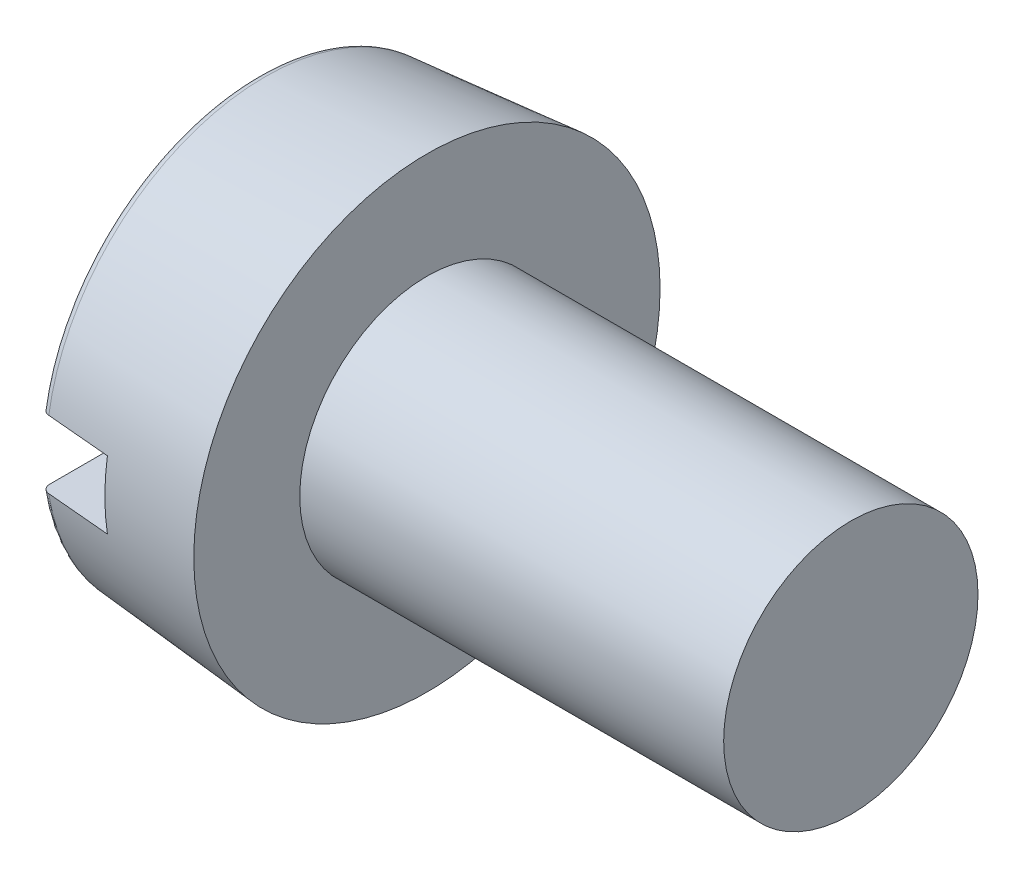
ISO-10303-21;
HEADER;
FILE_DESCRIPTION(('STEP AP214'),'2;1');
FILE_NAME('part.step','',(''),(''),'','','');
FILE_SCHEMA(('AUTOMOTIVE_DESIGN { 1 0 10303 214 1 1 1 1 }'));
ENDSEC;
DATA;
#1=APPLICATION_CONTEXT('core data for automotive mechanical design processes');
#2=APPLICATION_PROTOCOL_DEFINITION('international standard','automotive_design',2000,#1);
#3=PRODUCT_CONTEXT('',#1,'mechanical');
#4=PRODUCT('Part','Part','',(#3));
#5=PRODUCT_RELATED_PRODUCT_CATEGORY('part','',(#4));
#6=PRODUCT_DEFINITION_FORMATION('','',#4);
#7=PRODUCT_DEFINITION_CONTEXT('part definition',#1,'design');
#8=PRODUCT_DEFINITION('design','',#6,#7);
#9=PRODUCT_DEFINITION_SHAPE('','',#8);
#10=(LENGTH_UNIT() NAMED_UNIT(*) SI_UNIT(.MILLI.,.METRE.));
#11=(NAMED_UNIT(*) PLANE_ANGLE_UNIT() SI_UNIT($,.RADIAN.));
#12=(NAMED_UNIT(*) SI_UNIT($,.STERADIAN.) SOLID_ANGLE_UNIT());
#13=UNCERTAINTY_MEASURE_WITH_UNIT(LENGTH_MEASURE(1.E-05),#10,'distance_accuracy_value','');
#14=(GEOMETRIC_REPRESENTATION_CONTEXT(3) GLOBAL_UNCERTAINTY_ASSIGNED_CONTEXT((#13)) GLOBAL_UNIT_ASSIGNED_CONTEXT((#10,
#11,#12)) REPRESENTATION_CONTEXT('',''));
#15=CARTESIAN_POINT('',(0.,0.,0.));
#16=DIRECTION('',(0.,0.,1.));
#17=DIRECTION('',(1.,0.,0.));
#18=AXIS2_PLACEMENT_3D('',#15,#16,#17);
#19=CARTESIAN_POINT('',(0.,0.,0.));
#20=DIRECTION('',(-1.,0.,0.));
#21=DIRECTION('',(0.,0.,1.));
#22=AXIS2_PLACEMENT_3D('',#19,#20,#21);
#23=PLANE('',#22);
#24=DIRECTION('',(0.,0.,-1.));
#25=VECTOR('',#24,1.);
#26=CARTESIAN_POINT('',(0.,0.4,2.75));
#27=LINE('',#26,#25);
#28=CARTESIAN_POINT('',(0.,0.4,2.45096382768024));
#29=VERTEX_POINT('',#28);
#30=CARTESIAN_POINT('',(0.,0.4,-2.45096382768024));
#31=VERTEX_POINT('',#30);
#32=EDGE_CURVE('E100',#29,#31,#27,.T.);
#33=ORIENTED_EDGE('',*,*,#32,.F.);
#34=CARTESIAN_POINT('',(0.,0.,0.));
#35=DIRECTION('',(-1.,0.,0.));
#36=DIRECTION('',(0.,0.,1.));
#37=AXIS2_PLACEMENT_3D('',#34,#35,#36);
#38=CIRCLE('',#37,2.48338955554641);
#39=EDGE_CURVE('E102',#29,#31,#38,.T.);
#40=ORIENTED_EDGE('',*,*,#39,.T.);
#41=EDGE_LOOP('',(#33,#40));
#42=FACE_BOUND('',#41,.T.);
#43=ADVANCED_FACE('F31',(#42),#23,.T.);
#44=CARTESIAN_POINT('',(0.1,0.,0.));
#45=DIRECTION('',(-1.,0.,0.));
#46=DIRECTION('',(0.,0.,1.));
#47=AXIS2_PLACEMENT_3D('',#44,#45,#46);
#48=TOROIDAL_SURFACE('',#47,2.48338955554641,0.1);
#49=CARTESIAN_POINT('',(0.048575166156891,0.4,-2.53782400375256));
#50=CARTESIAN_POINT('',(0.0533355606484265,0.4,-2.54071333010714));
#51=CARTESIAN_POINT('',(0.0583417569081191,0.4,-2.5432050070476));
#52=CARTESIAN_POINT('',(0.0687050566270678,0.4,-2.54731542775851));
#53=CARTESIAN_POINT('',(0.0740625331074315,0.4,-2.5489332261633));
#54=CARTESIAN_POINT('',(0.0849727450829074,0.4,-2.55124400653277));
#55=CARTESIAN_POINT('',(0.0905254381371243,0.4,-2.55193718825242));
#56=CARTESIAN_POINT('',(0.101666850403571,0.4,-2.55237774737396));
#57=CARTESIAN_POINT('',(0.107255560960915,0.4,-2.55212534411489));
#58=CARTESIAN_POINT('',(0.11829297747771,0.4,-2.55068537304434));
#59=CARTESIAN_POINT('',(0.12374207216062,0.4,-2.54950078182478));
#60=CARTESIAN_POINT('',(0.134364973548135,0.4,-2.54623584290949));
#61=CARTESIAN_POINT('',(0.139538770226995,0.4,-2.54415546261615));
#62=CARTESIAN_POINT('',(0.149479719032406,0.4,-2.53915450094368));
#63=CARTESIAN_POINT('',(0.154245774280698,0.4,-2.5362317402539));
#64=CARTESIAN_POINT('',(0.163225267082159,0.4,-2.52963434266423));
#65=CARTESIAN_POINT('',(0.167438683516508,0.4,-2.52595967704439));
#66=CARTESIAN_POINT('',(0.175235238754911,0.4,-2.51792797325945));
#67=CARTESIAN_POINT('',(0.178812290222121,0.4,-2.51356502728085));
#68=CARTESIAN_POINT('',(0.185193520606352,0.4,-2.50430657366979));
#69=CARTESIAN_POINT('',(0.187997652806075,0.4,-2.49941103387087));
#70=CARTESIAN_POINT('',(0.192789155673773,0.4,-2.48916309698215));
#71=CARTESIAN_POINT('',(0.194766254858682,0.4,-2.48380589705));
#72=CARTESIAN_POINT('',(0.197803265284972,0.4,-2.47283752208988));
#73=CARTESIAN_POINT('',(0.198863119308795,0.4,-2.46722633124097));
#74=CARTESIAN_POINT('',(0.200044847417698,0.4,-2.45584788057293));
#75=CARTESIAN_POINT('',(0.200157020578001,0.4,-2.45007961163345));
#76=CARTESIAN_POINT('',(0.199415505351017,0.4,-2.43860536306505));
#77=CARTESIAN_POINT('',(0.198561783586786,0.4,-2.43289938559553));
#78=CARTESIAN_POINT('',(0.195905910130036,0.4,-2.42168897882671));
#79=CARTESIAN_POINT('',(0.19410009575039,0.4,-2.41618541629421));
#80=CARTESIAN_POINT('',(0.189585917001447,0.4,-2.40556157634262));
#81=CARTESIAN_POINT('',(0.186877563222537,0.4,-2.40044129442699));
#82=CARTESIAN_POINT('',(0.180646274399764,0.4,-2.39075689405528));
#83=CARTESIAN_POINT('',(0.177127233156936,0.4,-2.38619027144736));
#84=CARTESIAN_POINT('',(0.169364105535691,0.4,-2.37772142685885));
#85=CARTESIAN_POINT('',(0.165120062398033,0.4,-2.37381916528196));
#86=CARTESIAN_POINT('',(0.156079956749281,0.4,-2.36683969538108));
#87=CARTESIAN_POINT('',(0.151290949374608,0.4,-2.36375335061032));
#88=CARTESIAN_POINT('',(0.141257231753732,0.4,-2.35844131597663));
#89=CARTESIAN_POINT('',(0.136012558112743,0.4,-2.35621555705808));
#90=CARTESIAN_POINT('',(0.125292467405883,0.4,-2.35271848818592));
#91=CARTESIAN_POINT('',(0.119821114682517,0.4,-2.35143471451816));
#92=CARTESIAN_POINT('',(0.108740070260531,0.4,-2.3498129641862));
#93=CARTESIAN_POINT('',(0.103130386873387,0.4,-2.34947493083703));
#94=CARTESIAN_POINT('',(0.0919839198921386,0.4,-2.34975394655982));
#95=CARTESIAN_POINT('',(0.0864469267457431,0.4,-2.3503627089689));
#96=CARTESIAN_POINT('',(0.0755538584306503,0.4,-2.35250103603832));
#97=CARTESIAN_POINT('',(0.070197781285212,0.4,-2.35403059063437));
#98=CARTESIAN_POINT('',(0.0598152881139403,0.4,-2.35796437216879));
#99=CARTESIAN_POINT('',(0.0547889842764087,0.4,-2.36036889496733));
#100=CARTESIAN_POINT('',(0.045206465542065,0.4,-2.36598034847398));
#101=CARTESIAN_POINT('',(0.0406502682628032,0.4,-2.36918730923854));
#102=CARTESIAN_POINT('',(0.0320917632238241,0.4,-2.37634229232291));
#103=CARTESIAN_POINT('',(0.028094870668273,0.4,-2.38029679006583));
#104=CARTESIAN_POINT('',(0.0208109892284717,0.4,-2.3888128469718));
#105=CARTESIAN_POINT('',(0.0175240500802512,0.4,-2.39337444862957));
#106=CARTESIAN_POINT('',(0.0117067345908037,0.4,-2.4030406846898));
#107=CARTESIAN_POINT('',(0.00918709442735102,0.4,-2.40815178065126));
#108=CARTESIAN_POINT('',(0.00503040363865644,0.4,-2.41872109198935));
#109=CARTESIAN_POINT('',(0.00339341411876215,0.4,-2.42417933136926));
#110=CARTESIAN_POINT('',(0.00103079629344816,0.4,-2.4353556964236));
#111=CARTESIAN_POINT('',(0.000315915351137675,0.4,-2.44107609603135));
#112=CARTESIAN_POINT('',(-0.000148268658822413,0.4,-2.45255584173235));
#113=CARTESIAN_POINT('',(0.000102427694162753,0.4,-2.45831518780223));
#114=CARTESIAN_POINT('',(0.00156672863514003,0.4,-2.46973701475673));
#115=CARTESIAN_POINT('',(0.0027847125800623,0.4,-2.47539893515676));
#116=CARTESIAN_POINT('',(0.00615802275625704,0.4,-2.48643816300119));
#117=CARTESIAN_POINT('',(0.00831357182420314,0.4,-2.49181540244276));
#118=CARTESIAN_POINT('',(0.0134950186698153,0.4,-2.50210927446436));
#119=CARTESIAN_POINT('',(0.0165179085314691,0.4,-2.50702742235159));
#120=CARTESIAN_POINT('',(0.0233527300396537,0.4,-2.51627478169689));
#121=CARTESIAN_POINT('',(0.0271636671469903,0.4,-2.52060472418424));
#122=CARTESIAN_POINT('',(0.033939019894037,0.4,-2.52708853011278));
#123=CARTESIAN_POINT('',(0.0367007352855006,0.4,-2.52945777664795));
#124=CARTESIAN_POINT('',(0.0424651118142487,0.4,-2.5338824942972));
#125=CARTESIAN_POINT('',(0.0454677714717265,0.4,-2.53593796733816));
#126=CARTESIAN_POINT('',(0.048575166156891,0.4,-2.53782400375256));
#127=B_SPLINE_CURVE_WITH_KNOTS('',3,(#49,#50,#51,#52,#53,#54,#55,#56,#57,#58,#59,#60,#61,#62,
#63,#64,#65,#66,#67,#68,#69,#70,#71,#72,#73,#74,#75,#76,#77,#78,#79,#80,#81,#82,#83,#84,#85,#86,
#87,#88,#89,#90,#91,#92,#93,#94,#95,#96,#97,#98,#99,#100,#101,#102,#103,#104,#105,#106,#107,
#108,#109,#110,#111,#112,#113,#114,#115,#116,#117,#118,#119,#120,#121,#122,#123,#124,#125,#126),
.UNSPECIFIED.,.T.,.F.,(4,2,2,2,2,2,2,2,2,2,2,2,2,2,2,2,2,2,2,2,2,2,2,2,2,2,2,2,2,2,2,2,2,2,2,2,
2,2,4),(0.,0.0166927261929598,0.0334034746677628,0.0501106123530615,0.0668138748703245,
0.083464017157052,0.100114765390759,0.116808983272007,0.133503838928812,0.150350686192216,
0.167198551500755,0.184249859151125,0.201302230381806,0.21852894916341,0.235756263240368,
0.253050339384405,0.270344212607132,0.287556692602934,0.304768146365554,0.321777815466104,
0.338786119383576,0.355565109802712,0.372343094515803,0.388975057176048,0.405606838051781,
0.422244248001945,0.438882281223626,0.455671655511419,0.472462205603378,0.489477908753089,
0.506494789738005,0.523708265225893,0.54092173038536,0.558213576203892,0.575509534125873,
0.592746220451118,0.609961284890883,0.620857694274183,0.631754036740157),.UNSPECIFIED.);
#128=CARTESIAN_POINT('',(0.0912844257247913,0.4,-2.55184945188353));
#129=VERTEX_POINT('',#128);
#130=EDGE_CURVE('E55',#31,#129,#127,.T.);
#131=ORIENTED_EDGE('',*,*,#130,.F.);
#132=ORIENTED_EDGE('',*,*,#39,.F.);
#133=CARTESIAN_POINT('',(0.0660871367924748,0.4,2.35559521523855));
#134=CARTESIAN_POINT('',(0.0712950927848405,0.4,2.35369117822232));
#135=CARTESIAN_POINT('',(0.0766668570413199,0.4,2.35222401932616));
#136=CARTESIAN_POINT('',(0.0875846729626099,0.4,2.35021144655486));
#137=CARTESIAN_POINT('',(0.0931309090012396,0.4,2.34966704357885));
#138=CARTESIAN_POINT('',(0.10423434578276,0.4,2.34951890222007));
#139=CARTESIAN_POINT('',(0.109791541651094,0.4,2.34991481223107));
#140=CARTESIAN_POINT('',(0.120758977338572,0.4,2.35163438903106));
#141=CARTESIAN_POINT('',(0.126169249425604,0.4,2.3529578503682));
#142=CARTESIAN_POINT('',(0.136691070159668,0.4,2.35649136337689));
#143=CARTESIAN_POINT('',(0.141802658139017,0.4,2.35870129801009));
#144=CARTESIAN_POINT('',(0.151586618009317,0.4,2.36394124838263));
#145=CARTESIAN_POINT('',(0.156258960997779,0.4,2.36697131803635));
#146=CARTESIAN_POINT('',(0.165074157354302,0.4,2.37379047063628));
#147=CARTESIAN_POINT('',(0.169212326798594,0.4,2.37758560642957));
#148=CARTESIAN_POINT('',(0.176803016968956,0.4,2.38580863243915));
#149=CARTESIAN_POINT('',(0.180255493017442,0.4,2.39023656385406));
#150=CARTESIAN_POINT('',(0.186425395678718,0.4,2.39966205876259));
#151=CARTESIAN_POINT('',(0.189132494897015,0.4,2.40466638257535));
#152=CARTESIAN_POINT('',(0.19367967078828,0.4,2.41505452836032));
#153=CARTESIAN_POINT('',(0.195519689004032,0.4,2.42043837589129));
#154=CARTESIAN_POINT('',(0.19830186658775,0.4,2.43150243878165));
#155=CARTESIAN_POINT('',(0.199232942923701,0.4,2.43718544303412));
#156=CARTESIAN_POINT('',(0.200133721631402,0.4,2.44862724862863));
#157=CARTESIAN_POINT('',(0.200103382520145,0.4,2.45438605323057));
#158=CARTESIAN_POINT('',(0.199078617330099,0.4,2.46584997721002));
#159=CARTESIAN_POINT('',(0.198078795088567,0.4,2.47155461557154));
#160=CARTESIAN_POINT('',(0.195132850395625,0.4,2.48271426222291));
#161=CARTESIAN_POINT('',(0.193186731461064,0.4,2.4881692714404));
#162=CARTESIAN_POINT('',(0.188406932533008,0.4,2.49865615099338));
#163=CARTESIAN_POINT('',(0.185575905837541,0.4,2.50368922996592));
#164=CARTESIAN_POINT('',(0.179101091115397,0.4,2.51320240525564));
#165=CARTESIAN_POINT('',(0.175457341207139,0.4,2.51768252749234));
#166=CARTESIAN_POINT('',(0.167497937800454,0.4,2.52591455321073));
#167=CARTESIAN_POINT('',(0.163189244193141,0.4,2.52967318474522));
#168=CARTESIAN_POINT('',(0.153995338004761,0.4,2.53640297535422));
#169=CARTESIAN_POINT('',(0.149110165043673,0.4,2.53937418850051));
#170=CARTESIAN_POINT('',(0.138966186483439,0.4,2.54440671179074));
#171=CARTESIAN_POINT('',(0.133712676926899,0.4,2.54647869854792));
#172=CARTESIAN_POINT('',(0.122930387636139,0.4,2.54970170625043));
#173=CARTESIAN_POINT('',(0.11740162440989,0.4,2.55085278235563));
#174=CARTESIAN_POINT('',(0.106281963774288,0.4,2.55219206612031));
#175=CARTESIAN_POINT('',(0.100692150468509,0.4,2.55238928817214));
#176=CARTESIAN_POINT('',(0.0895592860464744,0.4,2.55183933800322));
#177=CARTESIAN_POINT('',(0.084016233633274,0.4,2.55109219206242));
#178=CARTESIAN_POINT('',(0.0731512358601834,0.4,2.5486799701557));
#179=CARTESIAN_POINT('',(0.0678286781135668,0.4,2.54701764956405));
#180=CARTESIAN_POINT('',(0.0575363587723272,0.4,2.54282694850188));
#181=CARTESIAN_POINT('',(0.0525666019474389,0.4,2.54029855632511));
#182=CARTESIAN_POINT('',(0.0430955298033929,0.4,2.53443716654266));
#183=CARTESIAN_POINT('',(0.0385964469739406,0.4,2.53110056307376));
#184=CARTESIAN_POINT('',(0.0302151234190864,0.4,2.52372648341994));
#185=CARTESIAN_POINT('',(0.0263329113383121,0.4,2.51968897470644));
#186=CARTESIAN_POINT('',(0.0192521281963955,0.4,2.51098384815933));
#187=CARTESIAN_POINT('',(0.0160610119836797,0.4,2.5063101674796));
#188=CARTESIAN_POINT('',(0.0104977647710909,0.4,2.49649850826804));
#189=CARTESIAN_POINT('',(0.008125688056225,0.4,2.49136049898949));
#190=CARTESIAN_POINT('',(0.00423822124527595,0.4,2.48069955197135));
#191=CARTESIAN_POINT('',(0.00273352009700214,0.4,2.4751727157723));
#192=CARTESIAN_POINT('',(0.000664174238576025,0.4,2.4639457200927));
#193=CARTESIAN_POINT('',(9.95845082644301E-05,0.4,2.45824555049506));
#194=CARTESIAN_POINT('',(-7.62295306058083E-05,0.4,2.4467793069312));
#195=CARTESIAN_POINT('',(0.000321125140370782,0.4,2.44101309976124));
#196=CARTESIAN_POINT('',(0.00207635443678246,0.4,2.42962883569642));
#197=CARTESIAN_POINT('',(0.00343421550729679,0.4,2.424010776712));
#198=CARTESIAN_POINT('',(0.00707734815742784,0.4,2.41307368443565));
#199=CARTESIAN_POINT('',(0.00936409323791585,0.4,2.40775514160471));
#200=CARTESIAN_POINT('',(0.0148046906814124,0.4,2.39757966614318));
#201=CARTESIAN_POINT('',(0.0179587364122388,0.4,2.39272283677864));
#202=CARTESIAN_POINT('',(0.0250240732994678,0.4,2.38364579035037));
#203=CARTESIAN_POINT('',(0.028930393182573,0.4,2.37942170099146));
#204=CARTESIAN_POINT('',(0.0374021808573991,0.4,2.3717039963052));
#205=CARTESIAN_POINT('',(0.0419667955357701,0.4,2.36820944966134));
#206=CARTESIAN_POINT('',(0.0498248602432987,0.4,2.36320077013841));
#207=CARTESIAN_POINT('',(0.0529598990957758,0.4,2.36143340044221));
#208=CARTESIAN_POINT('',(0.0594027181877436,0.4,2.35824787663633));
#209=CARTESIAN_POINT('',(0.0627104972052009,0.4,2.35682972005658));
#210=CARTESIAN_POINT('',(0.0660871367924748,0.4,2.35559521523855));
#211=B_SPLINE_CURVE_WITH_KNOTS('',3,(#133,#134,#135,#136,#137,#138,#139,#140,#141,#142,#143,
#144,#145,#146,#147,#148,#149,#150,#151,#152,#153,#154,#155,#156,#157,#158,#159,#160,#161,#162,
#163,#164,#165,#166,#167,#168,#169,#170,#171,#172,#173,#174,#175,#176,#177,#178,#179,#180,#181,
#182,#183,#184,#185,#186,#187,#188,#189,#190,#191,#192,#193,#194,#195,#196,#197,#198,#199,#200,
#201,#202,#203,#204,#205,#206,#207,#208,#209,#210),.UNSPECIFIED.,.T.,.F.,(4,2,2,2,2,2,2,2,2,2,2,
2,2,2,2,2,2,2,2,2,2,2,2,2,2,2,2,2,2,2,2,2,2,2,2,2,2,2,4),(0.,0.0166222541478178,
0.0332627065942931,0.0498969377446,0.0665274855903882,0.0831558384784716,0.0997852847538597,
0.116551858795267,0.133319524934732,0.150308994702433,0.16729960970923,0.184494901354412,
0.201690934940426,0.218983234681924,0.236275470158237,0.253516346249615,0.270756413877769,
0.287826942378046,0.304896298346318,0.321757040586668,0.338616772841758,0.355316856730834,
0.372016475898999,0.388666089268514,0.405315927691638,0.422041464353441,0.438767777445074,
0.455666404024134,0.472566150410065,0.489669935249993,0.506774720322792,0.524032613353523,
0.541290262841154,0.558575395944134,0.575864385959096,0.593042819367108,0.610199187265657,
0.620976497689188,0.631753731880016),.UNSPECIFIED.);
#212=CARTESIAN_POINT('',(0.0912844257242422,0.4,2.55184945188577));
#213=VERTEX_POINT('',#212);
#214=EDGE_CURVE('E92',#213,#29,#211,.T.);
#215=ORIENTED_EDGE('',*,*,#214,.F.);
#216=CARTESIAN_POINT('',(0.0912844257252299,0.,0.));
#217=DIRECTION('',(-1.,0.,0.));
#218=DIRECTION('',(0.,0.,1.));
#219=AXIS2_PLACEMENT_3D('',#216,#217,#218);
#220=CIRCLE('',#219,2.58300902535558);
#221=EDGE_CURVE('E106',#129,#213,#220,.F.);
#222=ORIENTED_EDGE('',*,*,#221,.F.);
#223=EDGE_LOOP('',(#131,#132,#215,#222));
#224=FACE_BOUND('',#223,.T.);
#225=ADVANCED_FACE('F177',(#224),#48,.T.);
#226=CARTESIAN_POINT('',(-25.4,0.,0.));
#227=DIRECTION('',(-1.,0.,0.));
#228=DIRECTION('',(0.,0.,1.));
#229=AXIS2_PLACEMENT_3D('',#226,#227,#228);
#230=CYLINDRICAL_SURFACE('',#229,1.5);
#231=CARTESIAN_POINT('',(7.,0.,0.));
#232=DIRECTION('',(-1.,0.,0.));
#233=DIRECTION('',(0.,0.,1.));
#234=AXIS2_PLACEMENT_3D('',#231,#232,#233);
#235=CIRCLE('',#234,1.5);
#236=CARTESIAN_POINT('',(7.,0.,1.5));
#237=VERTEX_POINT('',#236);
#238=EDGE_CURVE('E103',#237,#237,#235,.T.);
#239=ORIENTED_EDGE('',*,*,#238,.T.);
#240=EDGE_LOOP('',(#239));
#241=FACE_BOUND('',#240,.T.);
#242=CARTESIAN_POINT('',(2.,0.,0.));
#243=DIRECTION('',(-1.,0.,0.));
#244=DIRECTION('',(0.,0.,1.));
#245=AXIS2_PLACEMENT_3D('',#242,#243,#244);
#246=CIRCLE('',#245,1.5);
#247=CARTESIAN_POINT('',(2.,0.,1.5));
#248=VERTEX_POINT('',#247);
#249=EDGE_CURVE('E164',#248,#248,#246,.T.);
#250=ORIENTED_EDGE('',*,*,#249,.F.);
#251=EDGE_LOOP('',(#250));
#252=FACE_BOUND('',#251,.T.);
#253=ADVANCED_FACE('F174',(#241,#252),#230,.T.);
#254=CARTESIAN_POINT('',(7.,1.5,0.));
#255=DIRECTION('',(1.,0.,0.));
#256=DIRECTION('',(0.,0.,-1.));
#257=AXIS2_PLACEMENT_3D('',#254,#255,#256);
#258=PLANE('',#257);
#259=ORIENTED_EDGE('',*,*,#238,.F.);
#260=EDGE_LOOP('',(#259));
#261=FACE_BOUND('',#260,.T.);
#262=ADVANCED_FACE('F176',(#261),#258,.T.);
#263=DIRECTION('',(0.,0.,1.));
#264=VECTOR('',#263,1.);
#265=CARTESIAN_POINT('',(0.,-0.4,-2.75));
#266=LINE('',#265,#264);
#267=CARTESIAN_POINT('',(0.,-0.4,-2.45096382768024));
#268=VERTEX_POINT('',#267);
#269=CARTESIAN_POINT('',(0.,-0.4,2.45096382768024));
#270=VERTEX_POINT('',#269);
#271=EDGE_CURVE('E47',#268,#270,#266,.T.);
#272=ORIENTED_EDGE('',*,*,#271,.F.);
#273=EDGE_CURVE('E98',#268,#270,#38,.T.);
#274=ORIENTED_EDGE('',*,*,#273,.T.);
#275=EDGE_LOOP('',(#272,#274));
#276=FACE_BOUND('',#275,.T.);
#277=ADVANCED_FACE('F97',(#276),#23,.T.);
#278=CARTESIAN_POINT('',(0.,0.,0.));
#279=DIRECTION('',(1.,0.,0.));
#280=DIRECTION('',(0.,0.,-1.));
#281=AXIS2_PLACEMENT_3D('',#278,#279,#280);
#282=CONICAL_SURFACE('',#281,2.57502267294815,0.0872664625997166);
#283=CARTESIAN_POINT('',(-4.36225986914578,0.4,-2.15659249784001));
#284=CARTESIAN_POINT('',(-3.0225287932993,0.4,-2.27578971400985));
#285=CARTESIAN_POINT('',(-1.68277158070832,0.4,-2.3946924855258));
#286=CARTESIAN_POINT('',(-0.087192971572956,0.4,-2.53604555798389));
#287=CARTESIAN_POINT('',(0.168610376643266,0.4,-2.55869953286896));
#288=CARTESIAN_POINT('',(2.02000114161502,0.4,-2.72260692865391));
#289=CARTESIAN_POINT('',(3.61561248830953,0.4,-2.86359016848939));
#290=CARTESIAN_POINT('',(5.21123588736543,0.4,-3.00443640584799));
#291=B_SPLINE_CURVE_WITH_KNOTS('',3,(#283,#284,#285,#286,#287,#288,#289,#290),.UNSPECIFIED.,.F.,
.F.,(4,2,2,4),(0.,4.03506939923899,4.80548292410975,9.61096578658458),.UNSPECIFIED.);
#292=CARTESIAN_POINT('',(0.85,0.4,-2.61901832187334));
#293=VERTEX_POINT('',#292);
#294=EDGE_CURVE('E159',#129,#293,#291,.T.);
#295=ORIENTED_EDGE('',*,*,#294,.F.);
#296=ORIENTED_EDGE('',*,*,#221,.T.);
#297=CARTESIAN_POINT('',(5.21123588736543,0.4,3.00443640584799));
#298=CARTESIAN_POINT('',(4.41342358696222,0.4,2.93401988873196));
#299=CARTESIAN_POINT('',(3.61561486907633,0.4,2.86356274948076));
#300=CARTESIAN_POINT('',(2.02000692465129,0.4,2.72254136292326));
#301=CARTESIAN_POINT('',(1.22220769811185,0.4,2.65197711562021));
#302=CARTESIAN_POINT('',(-0.373378996688642,0.4,2.51071564393346));
#303=CARTESIAN_POINT('',(-1.17116646494953,0.4,2.44001841954794));
#304=CARTESIAN_POINT('',(-2.76672581923324,0.4,2.298448092182));
#305=CARTESIAN_POINT('',(-3.56449770525558,0.4,2.22757498919617));
#306=CARTESIAN_POINT('',(-4.36225986914578,0.4,2.15659249784001));
#307=B_SPLINE_CURVE_WITH_KNOTS('',3,(#297,#298,#299,#300,#301,#302,#303,#304,#305,#306),
.UNSPECIFIED.,.F.,.F.,(4,2,2,2,4),(0.,2.40274147318214,4.80548287330204,7.20822430613117,
9.6109658126378),.UNSPECIFIED.);
#308=CARTESIAN_POINT('',(0.85,0.4,2.61901832187334));
#309=VERTEX_POINT('',#308);
#310=EDGE_CURVE('E155',#309,#213,#307,.T.);
#311=ORIENTED_EDGE('',*,*,#310,.F.);
#312=CARTESIAN_POINT('',(0.85,0.,0.));
#313=DIRECTION('',(-1.,0.,0.));
#314=DIRECTION('',(0.,0.,1.));
#315=AXIS2_PLACEMENT_3D('',#312,#313,#314);
#316=CIRCLE('',#315,2.64938803694519);
#317=CARTESIAN_POINT('',(0.85,-0.4,2.61901832187334));
#318=VERTEX_POINT('',#317);
#319=EDGE_CURVE('E36',#309,#318,#316,.F.);
#320=ORIENTED_EDGE('',*,*,#319,.T.);
#321=CARTESIAN_POINT('',(-4.36225986914578,-0.4,2.15659249784001));
#322=CARTESIAN_POINT('',(-3.0225287932993,-0.4,2.27578971400985));
#323=CARTESIAN_POINT('',(-1.68277158070832,-0.4,2.3946924855258));
#324=CARTESIAN_POINT('',(-0.087192971572956,-0.4,2.53604555798389));
#325=CARTESIAN_POINT('',(0.168610376643266,-0.4,2.55869953286896));
#326=CARTESIAN_POINT('',(2.02000114161502,-0.4,2.72260692865391));
#327=CARTESIAN_POINT('',(3.61561248830953,-0.400000000000001,2.86359016848939));
#328=CARTESIAN_POINT('',(5.21123588736543,-0.4,3.00443640584799));
#329=B_SPLINE_CURVE_WITH_KNOTS('',3,(#321,#322,#323,#324,#325,#326,#327,#328),.UNSPECIFIED.,.F.,
.F.,(4,2,2,4),(0.,4.03506939923899,4.80548292410975,9.61096578658458),.UNSPECIFIED.);
#330=CARTESIAN_POINT('',(0.0912844257252299,-0.4,2.5518494518816));
#331=VERTEX_POINT('',#330);
#332=EDGE_CURVE('E133',#331,#318,#329,.T.);
#333=ORIENTED_EDGE('',*,*,#332,.F.);
#334=CARTESIAN_POINT('',(0.0912844257252299,-0.4,-2.55184945188164));
#335=VERTEX_POINT('',#334);
#336=EDGE_CURVE('E112',#331,#335,#220,.F.);
#337=ORIENTED_EDGE('',*,*,#336,.T.);
#338=CARTESIAN_POINT('',(5.21123588736543,-0.4,-3.00443640584799));
#339=CARTESIAN_POINT('',(4.41342358696222,-0.4,-2.93401988873196));
#340=CARTESIAN_POINT('',(3.61561486907633,-0.4,-2.86356274948076));
#341=CARTESIAN_POINT('',(2.02000692465129,-0.4,-2.72254136292326));
#342=CARTESIAN_POINT('',(1.22220769811185,-0.4,-2.65197711562021));
#343=CARTESIAN_POINT('',(-0.373378996688642,-0.4,-2.51071564393346));
#344=CARTESIAN_POINT('',(-1.17116646494953,-0.4,-2.44001841954794));
#345=CARTESIAN_POINT('',(-2.76672581923324,-0.4,-2.298448092182));
#346=CARTESIAN_POINT('',(-3.56449770525558,-0.4,-2.22757498919617));
#347=CARTESIAN_POINT('',(-4.36225986914578,-0.4,-2.15659249784001));
#348=B_SPLINE_CURVE_WITH_KNOTS('',3,(#338,#339,#340,#341,#342,#343,#344,#345,#346,#347),
.UNSPECIFIED.,.F.,.F.,(4,2,2,2,4),(0.,2.40274147318214,4.80548287330204,7.20822430613117,
9.6109658126378),.UNSPECIFIED.);
#349=CARTESIAN_POINT('',(0.85,-0.4,-2.61901832187334));
#350=VERTEX_POINT('',#349);
#351=EDGE_CURVE('E87',#350,#335,#348,.T.);
#352=ORIENTED_EDGE('',*,*,#351,.F.);
#353=EDGE_CURVE('E11',#350,#293,#316,.F.);
#354=ORIENTED_EDGE('',*,*,#353,.T.);
#355=EDGE_LOOP('',(#295,#296,#311,#320,#333,#337,#352,#354));
#356=FACE_BOUND('',#355,.T.);
#357=CARTESIAN_POINT('',(2.,0.,0.));
#358=DIRECTION('',(-1.,0.,0.));
#359=DIRECTION('',(0.,0.,1.));
#360=AXIS2_PLACEMENT_3D('',#357,#358,#359);
#361=CIRCLE('',#360,2.75);
#362=CARTESIAN_POINT('',(2.,0.,2.75));
#363=VERTEX_POINT('',#362);
#364=EDGE_CURVE('E108',#363,#363,#361,.T.);
#365=ORIENTED_EDGE('',*,*,#364,.T.);
#366=EDGE_LOOP('',(#365));
#367=FACE_BOUND('',#366,.T.);
#368=ADVANCED_FACE('F144',(#356,#367),#282,.T.);
#369=CARTESIAN_POINT('',(2.,1.5,0.));
#370=DIRECTION('',(-1.,0.,0.));
#371=DIRECTION('',(0.,0.,1.));
#372=AXIS2_PLACEMENT_3D('',#369,#370,#371);
#373=PLANE('',#372);
#374=ORIENTED_EDGE('',*,*,#364,.F.);
#375=EDGE_LOOP('',(#374));
#376=FACE_BOUND('',#375,.T.);
#377=ORIENTED_EDGE('',*,*,#249,.T.);
#378=EDGE_LOOP('',(#377));
#379=FACE_BOUND('',#378,.T.);
#380=ADVANCED_FACE('F148',(#376,#379),#373,.F.);
#381=CARTESIAN_POINT('',(0.048575166156891,-0.4,-2.53782400375256));
#382=CARTESIAN_POINT('',(0.0437427008890714,-0.4,-2.53489033603248));
#383=CARTESIAN_POINT('',(0.0391565039520041,-0.4,-2.53154249233901));
#384=CARTESIAN_POINT('',(0.0306096912349627,-0.4,-2.52411912703245));
#385=CARTESIAN_POINT('',(0.0266499199134268,-0.4,-2.52004263865816));
#386=CARTESIAN_POINT('',(0.0194724144414626,-0.4,-2.51128827187888));
#387=CARTESIAN_POINT('',(0.0162539430758676,-0.4,-2.5066109982245));
#388=CARTESIAN_POINT('',(0.0106407914468121,-0.4,-2.49678789814068));
#389=CARTESIAN_POINT('',(0.00824590952942863,-0.4,-2.49164218679789));
#390=CARTESIAN_POINT('',(0.0043228424573728,-0.4,-2.48097764448566));
#391=CARTESIAN_POINT('',(0.00280265847762351,-0.4,-2.47545587010949));
#392=CARTESIAN_POINT('',(0.000701595208248024,-0.4,-2.46423612609241));
#393=CARTESIAN_POINT('',(0.000120808101595798,-0.4,-2.45853813921568));
#394=CARTESIAN_POINT('',(-8.77639340342429E-05,-0.4,-2.44707338759541));
#395=CARTESIAN_POINT('',(0.000293055254025309,-0.4,-2.44130646469098));
#396=CARTESIAN_POINT('',(0.00201549855238182,-0.4,-2.42991778305268));
#397=CARTESIAN_POINT('',(0.00335714465243903,-0.4,-2.42429602764421));
#398=CARTESIAN_POINT('',(0.00696895281533353,-0.4,-2.41334782418293));
#399=CARTESIAN_POINT('',(0.00924075615667539,-0.4,-2.40802191712191));
#400=CARTESIAN_POINT('',(0.0146521431767627,-0.4,-2.39783066596844));
#401=CARTESIAN_POINT('',(0.0177917032773436,-0.4,-2.39296530936701));
#402=CARTESIAN_POINT('',(0.0248287411053439,-0.4,-2.38387042526437));
#403=CARTESIAN_POINT('',(0.0287209141925633,-0.4,-2.37963679509589));
#404=CARTESIAN_POINT('',(0.0371689847043478,-0.4,-2.37189344325919));
#405=CARTESIAN_POINT('',(0.0417248374973387,-0.4,-2.36838367295066));
#406=CARTESIAN_POINT('',(0.0513088940529654,-0.4,-2.36223607999804));
#407=CARTESIAN_POINT('',(0.0563303170031127,-0.4,-2.35958768701902));
#408=CARTESIAN_POINT('',(0.0667506637390637,-0.4,-2.35518417776549));
#409=CARTESIAN_POINT('',(0.0721495575296726,-0.4,-2.35342899060518));
#410=CARTESIAN_POINT('',(0.0830969218562004,-0.4,-2.35088371920364));
#411=CARTESIAN_POINT('',(0.0886425771214819,-0.4,-2.35008151768943));
#412=CARTESIAN_POINT('',(0.0997895698319834,-0.4,-2.34942645825663));
#413=CARTESIAN_POINT('',(0.105390904537028,-0.4,-2.34957355384856));
#414=CARTESIAN_POINT('',(0.116450989483532,-0.4,-2.35080823875911));
#415=CARTESIAN_POINT('',(0.121910439899226,-0.4,-2.35188957154329));
#416=CARTESIAN_POINT('',(0.132571054932582,-0.4,-2.35495102017176));
#417=CARTESIAN_POINT('',(0.137772218979377,-0.4,-2.35693113800247));
#418=CARTESIAN_POINT('',(0.147785607499864,-0.4,-2.36173694974296));
#419=CARTESIAN_POINT('',(0.152596707655126,-0.4,-2.36456498478211));
#420=CARTESIAN_POINT('',(0.161682450459403,-0.4,-2.37098051347151));
#421=CARTESIAN_POINT('',(0.165957067006596,-0.4,-2.3745680440511));
#422=CARTESIAN_POINT('',(0.173898476720827,-0.4,-2.38244089229649));
#423=CARTESIAN_POINT('',(0.177558250715634,-0.4,-2.38673328868116));
#424=CARTESIAN_POINT('',(0.184116745306165,-0.4,-2.39586460061934));
#425=CARTESIAN_POINT('',(0.187015411909099,-0.4,-2.40070355491074));
#426=CARTESIAN_POINT('',(0.1920102965789,-0.4,-2.41086084949244));
#427=CARTESIAN_POINT('',(0.194095133740737,-0.4,-2.41618478733958));
#428=CARTESIAN_POINT('',(0.197351618314204,-0.4,-2.42710502099882));
#429=CARTESIAN_POINT('',(0.198523208401552,-0.4,-2.43270133388441));
#430=CARTESIAN_POINT('',(0.199929764454566,-0.4,-2.44406834904127));
#431=CARTESIAN_POINT('',(0.200155100074746,-0.4,-2.4498402450028));
#432=CARTESIAN_POINT('',(0.199636288045938,-0.4,-2.4613404318168));
#433=CARTESIAN_POINT('',(0.198892115679426,-0.4,-2.46706872155379));
#434=CARTESIAN_POINT('',(0.196450104345965,-0.4,-2.4783334263322));
#435=CARTESIAN_POINT('',(0.19474990339858,-0.4,-2.48386932995355));
#436=CARTESIAN_POINT('',(0.190438851147455,-0.4,-2.49457461930592));
#437=CARTESIAN_POINT('',(0.187828017040739,-0.4,-2.49974401195618));
#438=CARTESIAN_POINT('',(0.18178416821025,-0.4,-2.50953562475824));
#439=CARTESIAN_POINT('',(0.178356081275476,-0.4,-2.51416088532287));
#440=CARTESIAN_POINT('',(0.170763854311403,-0.4,-2.52276187931021));
#441=CARTESIAN_POINT('',(0.166599755887439,-0.4,-2.52673764942296));
#442=CARTESIAN_POINT('',(0.157703749960622,-0.4,-2.53387831326103));
#443=CARTESIAN_POINT('',(0.152978790793139,-0.4,-2.53705186263633));
#444=CARTESIAN_POINT('',(0.143058302597854,-0.4,-2.54254944807672));
#445=CARTESIAN_POINT('',(0.137862824904435,-0.4,-2.54487357667608));
#446=CARTESIAN_POINT('',(0.127215096181335,-0.4,-2.54857855240269));
#447=CARTESIAN_POINT('',(0.121766627201613,-0.4,-2.54997027378005));
#448=CARTESIAN_POINT('',(0.110711267088447,-0.4,-2.55181190787766));
#449=CARTESIAN_POINT('',(0.105104343718789,-0.4,-2.55226162753717));
#450=CARTESIAN_POINT('',(0.0939347715007496,-0.4,-2.552205294953));
#451=CARTESIAN_POINT('',(0.0883720843451969,-0.4,-2.55170582304087));
#452=CARTESIAN_POINT('',(0.0774146742968055,-0.4,-2.54977933214903));
#453=CARTESIAN_POINT('',(0.0720197510015727,-0.4,-2.54835346819235));
#454=CARTESIAN_POINT('',(0.063613486179649,-0.4,-2.54535751471384));
#455=CARTESIAN_POINT('',(0.0605001894166254,-0.4,-2.54406538475537));
#456=CARTESIAN_POINT('',(0.0544205154682448,-0.4,-2.54117250369181));
#457=CARTESIAN_POINT('',(0.0514541373617029,-0.4,-2.53957175452209));
#458=CARTESIAN_POINT('',(0.048575166156891,-0.4,-2.53782400375256));
#459=B_SPLINE_CURVE_WITH_KNOTS('',3,(#381,#382,#383,#384,#385,#386,#387,#388,#389,#390,#391,
#392,#393,#394,#395,#396,#397,#398,#399,#400,#401,#402,#403,#404,#405,#406,#407,#408,#409,#410,
#411,#412,#413,#414,#415,#416,#417,#418,#419,#420,#421,#422,#423,#424,#425,#426,#427,#428,#429,
#430,#431,#432,#433,#434,#435,#436,#437,#438,#439,#440,#441,#442,#443,#444,#445,#446,#447,#448,
#449,#450,#451,#452,#453,#454,#455,#456,#457,#458),.UNSPECIFIED.,.T.,.F.,(4,2,2,2,2,2,2,2,2,2,2,
2,2,2,2,2,2,2,2,2,2,2,2,2,2,2,2,2,2,2,2,2,2,2,2,2,2,2,4),(0.,0.0169472407322672,
0.0339171361601506,0.0508700816238967,0.0678188732388524,0.0849203328631089,0.102023470551058,
0.119280182389638,0.136537289182897,0.153824978576453,0.171112198285484,0.188281743401668,
0.205450134421422,0.222399111451824,0.239346743182754,0.256076496133358,0.272805429792138,
0.289423191548409,0.306040990031791,0.322705100111853,0.339370020645595,0.356213876748639,
0.373058927428501,0.390131760531073,0.407205665204685,0.424452921752969,0.441700618027207,
0.458991115172603,0.476281285810015,0.493469727421073,0.510657197712654,0.527650439747465,
0.544641830018657,0.561431437560975,0.578224485752214,0.594901539591072,0.611557840324385,
0.621654327588065,0.631750751538408),.UNSPECIFIED.);
#460=EDGE_CURVE('E83',#335,#268,#459,.T.);
#461=ORIENTED_EDGE('',*,*,#460,.F.);
#462=ORIENTED_EDGE('',*,*,#336,.F.);
#463=CARTESIAN_POINT('',(0.0660871367924749,-0.4,2.35559521523855));
#464=CARTESIAN_POINT('',(0.0608105945502038,-0.4,2.35752487852842));
#465=CARTESIAN_POINT('',(0.0556944752428509,-0.4,2.3599059129028));
#466=CARTESIAN_POINT('',(0.0459323966354484,-0.4,2.36549830449194));
#467=CARTESIAN_POINT('',(0.0412870687197798,-0.4,2.36871075675094));
#468=CARTESIAN_POINT('',(0.032604379070265,-0.4,2.37586468923515));
#469=CARTESIAN_POINT('',(0.0285663918791524,-0.4,2.37980541001391));
#470=CARTESIAN_POINT('',(0.0212026684834657,-0.4,2.38830165313251));
#471=CARTESIAN_POINT('',(0.0178767642753712,-0.4,2.39285703004061));
#472=CARTESIAN_POINT('',(0.011993454988691,-0.4,2.4025019984765));
#473=CARTESIAN_POINT('',(0.00944402228749019,-0.4,2.40759645260631));
#474=CARTESIAN_POINT('',(0.0052251979680423,-0.4,2.41813782358851));
#475=CARTESIAN_POINT('',(0.0035559000210214,-0.4,2.42358477788764));
#476=CARTESIAN_POINT('',(0.00112661898390303,-0.4,2.43474435525461));
#477=CARTESIAN_POINT('',(0.000377433998971087,-0.4,2.44045933087073));
#478=CARTESIAN_POINT('',(-0.000155971609909065,-0.4,2.45193424749558));
#479=CARTESIAN_POINT('',(5.9843753921386E-05,-0.4,2.45769419017327));
#480=CARTESIAN_POINT('',(0.00145482264639185,-0.4,2.4691245835607));
#481=CARTESIAN_POINT('',(0.00263861487831216,-0.4,2.47479447055272));
#482=CARTESIAN_POINT('',(0.00594479382623154,-0.4,2.48585382181204));
#483=CARTESIAN_POINT('',(0.00806717094823211,-0.4,2.4912432889451));
#484=CARTESIAN_POINT('',(0.0131842826089137,-0.4,2.50156580381608));
#485=CARTESIAN_POINT('',(0.0161757093406998,-0.4,2.50650049043758));
#486=CARTESIAN_POINT('',(0.0229526816297061,-0.4,2.51579078048696));
#487=CARTESIAN_POINT('',(0.026738188211274,-0.4,2.52014641231933));
#488=CARTESIAN_POINT('',(0.0349549522819587,-0.4,2.52810621279062));
#489=CARTESIAN_POINT('',(0.0393791679507025,-0.4,2.53171764933511));
#490=CARTESIAN_POINT('',(0.0487773745070079,-0.4,2.53813557351638));
#491=CARTESIAN_POINT('',(0.0537513271234723,-0.4,2.54094211713863));
#492=CARTESIAN_POINT('',(0.0640426596902499,-0.4,2.54563498979798));
#493=CARTESIAN_POINT('',(0.0693551226039391,-0.4,2.5475321037118));
#494=CARTESIAN_POINT('',(0.0802247129351561,-0.4,2.55039839200113));
#495=CARTESIAN_POINT('',(0.0857818262597897,-0.4,2.55136761975382));
#496=CARTESIAN_POINT('',(0.0969295068477407,-0.4,2.55234385612009));
#497=CARTESIAN_POINT('',(0.102519326325114,-0.4,2.55235942192522));
#498=CARTESIAN_POINT('',(0.113621717842258,-0.4,2.55144947170831));
#499=CARTESIAN_POINT('',(0.119134291728872,-0.4,2.55052397822485));
#500=CARTESIAN_POINT('',(0.12991315715357,-0.4,2.54776325488686));
#501=CARTESIAN_POINT('',(0.135179979695444,-0.4,2.54593009634288));
#502=CARTESIAN_POINT('',(0.14533338195721,-0.4,2.54141002564133));
#503=CARTESIAN_POINT('',(0.150219955236063,-0.4,2.53872309902571));
#504=CARTESIAN_POINT('',(0.159502666916409,-0.4,2.5325586246071));
#505=CARTESIAN_POINT('',(0.163896113948941,-0.4,2.52907702558496));
#506=CARTESIAN_POINT('',(0.172043834916818,-0.4,2.52143276158102));
#507=CARTESIAN_POINT('',(0.175798076961159,-0.4,2.51727006263833));
#508=CARTESIAN_POINT('',(0.182604163786229,-0.4,2.50833478591539));
#509=CARTESIAN_POINT('',(0.185648086206779,-0.4,2.50355617440357));
#510=CARTESIAN_POINT('',(0.19090152145622,-0.4,2.49356047830666));
#511=CARTESIAN_POINT('',(0.193110979885753,-0.4,2.4883433651624));
#512=CARTESIAN_POINT('',(0.196659930990868,-0.4,2.47755170451601));
#513=CARTESIAN_POINT('',(0.197988676101266,-0.4,2.47197362162933));
#514=CARTESIAN_POINT('',(0.199699497616489,-0.4,2.46067407504842));
#515=CARTESIAN_POINT('',(0.200081523174489,-0.4,2.45495260366968));
#516=CARTESIAN_POINT('',(0.199888693786855,-0.4,2.44347761139863));
#517=CARTESIAN_POINT('',(0.199305786466706,-0.4,2.43772422417512));
#518=CARTESIAN_POINT('',(0.197183396962278,-0.4,2.42639649613519));
#519=CARTESIAN_POINT('',(0.195643893907937,-0.4,2.42082215922791));
#520=CARTESIAN_POINT('',(0.191647358782498,-0.4,2.41000689513081));
#521=CARTESIAN_POINT('',(0.189189525029138,-0.4,2.40476626395098));
#522=CARTESIAN_POINT('',(0.183422446278923,-0.4,2.39477626653133));
#523=CARTESIAN_POINT('',(0.180113225729291,-0.4,2.39002688619092));
#524=CARTESIAN_POINT('',(0.172762307166355,-0.4,2.38119455975028));
#525=CARTESIAN_POINT('',(0.168726370035365,-0.4,2.37710682086271));
#526=CARTESIAN_POINT('',(0.160017645288821,-0.4,2.36967805871209));
#527=CARTESIAN_POINT('',(0.155344928487096,-0.4,2.36633695252778));
#528=CARTESIAN_POINT('',(0.145561135599925,-0.4,2.36054338093363));
#529=CARTESIAN_POINT('',(0.140456663489582,-0.4,2.35807976269219));
#530=CARTESIAN_POINT('',(0.129901516966527,-0.4,2.35405629153212));
#531=CARTESIAN_POINT('',(0.12445078098188,-0.4,2.35249659984984));
#532=CARTESIAN_POINT('',(0.113430211306763,-0.4,2.35034396470641));
#533=CARTESIAN_POINT('',(0.107862588812257,-0.4,2.34973965558371));
#534=CARTESIAN_POINT('',(0.0967101969668423,-0.4,2.34948171969541));
#535=CARTESIAN_POINT('',(0.0911254588247305,-0.4,2.34982687285342));
#536=CARTESIAN_POINT('',(0.0822854426850385,-0.4,2.35112999215385));
#537=CARTESIAN_POINT('',(0.0789835903303941,-0.4,2.35179110990866));
#538=CARTESIAN_POINT('',(0.072464361176773,-0.4,2.35344593540385));
#539=CARTESIAN_POINT('',(0.0692469836329162,-0.4,2.3544396402105));
#540=CARTESIAN_POINT('',(0.0660871367924749,-0.4,2.35559521523855));
#541=B_SPLINE_CURVE_WITH_KNOTS('',3,(#463,#464,#465,#466,#467,#468,#469,#470,#471,#472,#473,
#474,#475,#476,#477,#478,#479,#480,#481,#482,#483,#484,#485,#486,#487,#488,#489,#490,#491,#492,
#493,#494,#495,#496,#497,#498,#499,#500,#501,#502,#503,#504,#505,#506,#507,#508,#509,#510,#511,
#512,#513,#514,#515,#516,#517,#518,#519,#520,#521,#522,#523,#524,#525,#526,#527,#528,#529,#530,
#531,#532,#533,#534,#535,#536,#537,#538,#539,#540),.UNSPECIFIED.,.T.,.F.,(4,2,2,2,2,2,2,2,2,2,2,
2,2,2,2,2,2,2,2,2,2,2,2,2,2,2,2,2,2,2,2,2,2,2,2,2,2,2,4),(0.,0.0168424750743688,
0.0337072469428214,0.0505545302746076,0.0673978343938469,0.0844086595317172,0.101421294737152,
0.118631732868635,0.135842812834709,0.153136677947411,0.170430366290294,0.187659074407731,
0.204886937089934,0.221937615090733,0.238987106819418,0.255829075426629,0.272670075131689,
0.289359938509868,0.306049402171548,0.3227009544545,0.339352788736639,0.356091488623029,
0.372831023386549,0.389749176795124,0.406668432921035,0.423790533399583,0.440913553459406,
0.458180186872608,0.475447197005395,0.492729316207192,0.51001093921539,0.527161157578304,
0.54430947028508,0.561231319691048,0.578156186574315,0.594878150313084,0.611578636064082,
0.621664807773931,0.631750890516262),.UNSPECIFIED.);
#542=EDGE_CURVE('E93',#270,#331,#541,.T.);
#543=ORIENTED_EDGE('',*,*,#542,.F.);
#544=ORIENTED_EDGE('',*,*,#273,.F.);
#545=EDGE_LOOP('',(#461,#462,#543,#544));
#546=FACE_BOUND('',#545,.T.);
#547=ADVANCED_FACE('F33',(#546),#48,.T.);
#548=CARTESIAN_POINT('',(0.85,0.4,2.75));
#549=DIRECTION('',(0.,1.,0.));
#550=DIRECTION('',(0.,0.,1.));
#551=AXIS2_PLACEMENT_3D('',#548,#549,#550);
#552=PLANE('',#551);
#553=ORIENTED_EDGE('',*,*,#294,.T.);
#554=DIRECTION('',(0.,0.,-1.));
#555=VECTOR('',#554,1.);
#556=CARTESIAN_POINT('',(0.85,0.4,2.75));
#557=LINE('',#556,#555);
#558=EDGE_CURVE('E99',#309,#293,#557,.T.);
#559=ORIENTED_EDGE('',*,*,#558,.F.);
#560=ORIENTED_EDGE('',*,*,#310,.T.);
#561=ORIENTED_EDGE('',*,*,#214,.T.);
#562=ORIENTED_EDGE('',*,*,#32,.T.);
#563=ORIENTED_EDGE('',*,*,#130,.T.);
#564=EDGE_LOOP('',(#553,#559,#560,#561,#562,#563));
#565=FACE_BOUND('',#564,.T.);
#566=ADVANCED_FACE('F125',(#565),#552,.F.);
#567=CARTESIAN_POINT('',(0.85,-0.4,-2.75));
#568=DIRECTION('',(0.,-1.,0.));
#569=DIRECTION('',(0.,0.,-1.));
#570=AXIS2_PLACEMENT_3D('',#567,#568,#569);
#571=PLANE('',#570);
#572=ORIENTED_EDGE('',*,*,#351,.T.);
#573=ORIENTED_EDGE('',*,*,#460,.T.);
#574=ORIENTED_EDGE('',*,*,#271,.T.);
#575=ORIENTED_EDGE('',*,*,#542,.T.);
#576=ORIENTED_EDGE('',*,*,#332,.T.);
#577=DIRECTION('',(0.,0.,1.));
#578=VECTOR('',#577,1.);
#579=CARTESIAN_POINT('',(0.85,-0.4,-2.75));
#580=LINE('',#579,#578);
#581=EDGE_CURVE('E138',#350,#318,#580,.T.);
#582=ORIENTED_EDGE('',*,*,#581,.F.);
#583=EDGE_LOOP('',(#572,#573,#574,#575,#576,#582));
#584=FACE_BOUND('',#583,.T.);
#585=ADVANCED_FACE('F84',(#584),#571,.F.);
#586=CARTESIAN_POINT('',(0.85,0.4,-2.75));
#587=DIRECTION('',(-1.,0.,0.));
#588=DIRECTION('',(0.,0.,1.));
#589=AXIS2_PLACEMENT_3D('',#586,#587,#588);
#590=PLANE('',#589);
#591=ORIENTED_EDGE('',*,*,#581,.T.);
#592=ORIENTED_EDGE('',*,*,#319,.F.);
#593=ORIENTED_EDGE('',*,*,#558,.T.);
#594=ORIENTED_EDGE('',*,*,#353,.F.);
#595=EDGE_LOOP('',(#591,#592,#593,#594));
#596=FACE_BOUND('',#595,.T.);
#597=ADVANCED_FACE('F124',(#596),#590,.T.);
#598=CLOSED_SHELL('',(#43,#225,#253,#262,#277,#368,#380,#547,#566,#585,#597));
#599=MANIFOLD_SOLID_BREP('B2',#598);
#600=ADVANCED_BREP_SHAPE_REPRESENTATION('',(#18,#599),#14);
#601=SHAPE_DEFINITION_REPRESENTATION(#9,#600);
ENDSEC;
END-ISO-10303-21;
